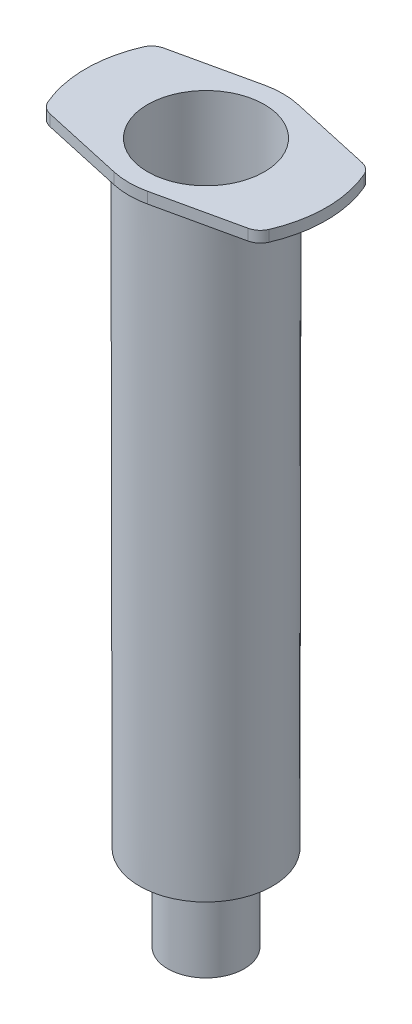
ISO-10303-21;
HEADER;
FILE_DESCRIPTION(('STEP AP214'),'2;1');
FILE_NAME('part.step','',(''),(''),'','','');
FILE_SCHEMA(('AUTOMOTIVE_DESIGN { 1 0 10303 214 1 1 1 1 }'));
ENDSEC;
DATA;
#1=APPLICATION_CONTEXT('core data for automotive mechanical design processes');
#2=APPLICATION_PROTOCOL_DEFINITION('international standard','automotive_design',2000,#1);
#3=PRODUCT_CONTEXT('',#1,'mechanical');
#4=PRODUCT('Part','Part','',(#3));
#5=PRODUCT_RELATED_PRODUCT_CATEGORY('part','',(#4));
#6=PRODUCT_DEFINITION_FORMATION('','',#4);
#7=PRODUCT_DEFINITION_CONTEXT('part definition',#1,'design');
#8=PRODUCT_DEFINITION('design','',#6,#7);
#9=PRODUCT_DEFINITION_SHAPE('','',#8);
#10=(LENGTH_UNIT() NAMED_UNIT(*) SI_UNIT(.MILLI.,.METRE.));
#11=(NAMED_UNIT(*) PLANE_ANGLE_UNIT() SI_UNIT($,.RADIAN.));
#12=(NAMED_UNIT(*) SI_UNIT($,.STERADIAN.) SOLID_ANGLE_UNIT());
#13=UNCERTAINTY_MEASURE_WITH_UNIT(LENGTH_MEASURE(1.E-05),#10,'distance_accuracy_value','');
#14=(GEOMETRIC_REPRESENTATION_CONTEXT(3) GLOBAL_UNCERTAINTY_ASSIGNED_CONTEXT((#13)) GLOBAL_UNIT_ASSIGNED_CONTEXT((#10,
#11,#12)) REPRESENTATION_CONTEXT('',''));
#15=CARTESIAN_POINT('',(0.,0.,0.));
#16=DIRECTION('',(0.,0.,1.));
#17=DIRECTION('',(1.,0.,0.));
#18=AXIS2_PLACEMENT_3D('',#15,#16,#17);
#19=CARTESIAN_POINT('',(0.,0.,0.));
#20=DIRECTION('',(0.,-1.,0.));
#21=DIRECTION('',(0.,0.,-1.));
#22=AXIS2_PLACEMENT_3D('',#19,#20,#21);
#23=CYLINDRICAL_SURFACE('',#22,7.2);
#24=CARTESIAN_POINT('',(0.,11.2004935058267,0.));
#25=DIRECTION('',(0.,-1.,0.));
#26=DIRECTION('',(0.,0.,-1.));
#27=AXIS2_PLACEMENT_3D('',#24,#25,#26);
#28=CIRCLE('',#27,7.2);
#29=CARTESIAN_POINT('',(0.,11.2004935058267,-7.2));
#30=VERTEX_POINT('',#29);
#31=EDGE_CURVE('E218',#30,#30,#28,.T.);
#32=ORIENTED_EDGE('',*,*,#31,.T.);
#33=EDGE_LOOP('',(#32));
#34=FACE_BOUND('',#33,.T.);
#35=CARTESIAN_POINT('',(0.,86.37,0.));
#36=DIRECTION('',(0.,1.,0.));
#37=DIRECTION('',(0.,0.,1.));
#38=AXIS2_PLACEMENT_3D('',#35,#36,#37);
#39=CIRCLE('',#38,7.2);
#40=CARTESIAN_POINT('',(0.,86.37,7.2));
#41=VERTEX_POINT('',#40);
#42=EDGE_CURVE('E155',#41,#41,#39,.T.);
#43=ORIENTED_EDGE('',*,*,#42,.T.);
#44=EDGE_LOOP('',(#43));
#45=FACE_BOUND('',#44,.T.);
#46=ADVANCED_FACE('F36',(#34,#45),#23,.F.);
#47=CARTESIAN_POINT('',(0.,11.2004935058267,0.));
#48=DIRECTION('',(0.,1.,0.));
#49=DIRECTION('',(0.,0.,1.));
#50=AXIS2_PLACEMENT_3D('',#47,#48,#49);
#51=CONICAL_SURFACE('',#50,7.2,1.11606303899452);
#52=CARTESIAN_POINT('',(0.,8.16927474800023,0.));
#53=DIRECTION('',(0.,-1.,0.));
#54=DIRECTION('',(0.,0.,-1.));
#55=AXIS2_PLACEMENT_3D('',#52,#53,#54);
#56=CIRCLE('',#55,1.);
#57=CARTESIAN_POINT('',(0.,8.16927474800023,-1.));
#58=VERTEX_POINT('',#57);
#59=EDGE_CURVE('E215',#58,#58,#56,.T.);
#60=ORIENTED_EDGE('',*,*,#59,.T.);
#61=EDGE_LOOP('',(#60));
#62=FACE_BOUND('',#61,.T.);
#63=ORIENTED_EDGE('',*,*,#31,.F.);
#64=EDGE_LOOP('',(#63));
#65=FACE_BOUND('',#64,.T.);
#66=ADVANCED_FACE('F298',(#62,#65),#51,.F.);
#67=CARTESIAN_POINT('',(0.,0.,0.));
#68=DIRECTION('',(0.,-1.,0.));
#69=DIRECTION('',(0.,0.,-1.));
#70=AXIS2_PLACEMENT_3D('',#67,#68,#69);
#71=CYLINDRICAL_SURFACE('',#70,1.);
#72=CARTESIAN_POINT('',(0.,0.,0.));
#73=DIRECTION('',(0.,-1.,0.));
#74=DIRECTION('',(0.,0.,-1.));
#75=AXIS2_PLACEMENT_3D('',#72,#73,#74);
#76=CIRCLE('',#75,1.);
#77=CARTESIAN_POINT('',(0.,0.,-1.));
#78=VERTEX_POINT('',#77);
#79=EDGE_CURVE('E212',#78,#78,#76,.T.);
#80=ORIENTED_EDGE('',*,*,#79,.T.);
#81=EDGE_LOOP('',(#80));
#82=FACE_BOUND('',#81,.T.);
#83=ORIENTED_EDGE('',*,*,#59,.F.);
#84=EDGE_LOOP('',(#83));
#85=FACE_BOUND('',#84,.T.);
#86=ADVANCED_FACE('F304',(#82,#85),#71,.F.);
#87=CARTESIAN_POINT('',(2.,0.,0.));
#88=DIRECTION('',(0.,-1.,0.));
#89=DIRECTION('',(0.,0.,-1.));
#90=AXIS2_PLACEMENT_3D('',#87,#88,#89);
#91=PLANE('',#90);
#92=CARTESIAN_POINT('',(0.,0.,0.));
#93=DIRECTION('',(0.,-1.,0.));
#94=DIRECTION('',(0.,0.,-1.));
#95=AXIS2_PLACEMENT_3D('',#92,#93,#94);
#96=CIRCLE('',#95,2.);
#97=CARTESIAN_POINT('',(0.,0.,-2.));
#98=VERTEX_POINT('',#97);
#99=EDGE_CURVE('E209',#98,#98,#96,.T.);
#100=ORIENTED_EDGE('',*,*,#99,.T.);
#101=EDGE_LOOP('',(#100));
#102=FACE_BOUND('',#101,.T.);
#103=ORIENTED_EDGE('',*,*,#79,.F.);
#104=EDGE_LOOP('',(#103));
#105=FACE_BOUND('',#104,.T.);
#106=ADVANCED_FACE('F475',(#102,#105),#91,.T.);
#107=CARTESIAN_POINT('',(0.,0.,0.));
#108=DIRECTION('',(0.,-1.,0.));
#109=DIRECTION('',(0.,0.,-1.));
#110=AXIS2_PLACEMENT_3D('',#107,#108,#109);
#111=CYLINDRICAL_SURFACE('',#110,2.);
#112=CARTESIAN_POINT('',(0.,4.39112903225807,0.));
#113=DIRECTION('',(0.,-1.,0.));
#114=DIRECTION('',(0.,0.,-1.));
#115=AXIS2_PLACEMENT_3D('',#112,#113,#114);
#116=CIRCLE('',#115,2.);
#117=CARTESIAN_POINT('',(0.,4.39112903225807,-2.));
#118=VERTEX_POINT('',#117);
#119=EDGE_CURVE('E206',#118,#118,#116,.T.);
#120=ORIENTED_EDGE('',*,*,#119,.T.);
#121=EDGE_LOOP('',(#120));
#122=FACE_BOUND('',#121,.T.);
#123=ORIENTED_EDGE('',*,*,#99,.F.);
#124=EDGE_LOOP('',(#123));
#125=FACE_BOUND('',#124,.T.);
#126=ADVANCED_FACE('F466',(#122,#125),#111,.T.);
#127=CARTESIAN_POINT('',(3.96,4.39112903225807,0.));
#128=DIRECTION('',(0.,-1.,0.));
#129=DIRECTION('',(0.,0.,-1.));
#130=AXIS2_PLACEMENT_3D('',#127,#128,#129);
#131=PLANE('',#130);
#132=CARTESIAN_POINT('',(0.,4.39112903225807,0.));
#133=DIRECTION('',(0.,-1.,0.));
#134=DIRECTION('',(0.,0.,-1.));
#135=AXIS2_PLACEMENT_3D('',#132,#133,#134);
#136=CIRCLE('',#135,3.96);
#137=CARTESIAN_POINT('',(0.,4.39112903225807,-3.96));
#138=VERTEX_POINT('',#137);
#139=EDGE_CURVE('E203',#138,#138,#136,.T.);
#140=ORIENTED_EDGE('',*,*,#139,.T.);
#141=EDGE_LOOP('',(#140));
#142=FACE_BOUND('',#141,.T.);
#143=ORIENTED_EDGE('',*,*,#119,.F.);
#144=EDGE_LOOP('',(#143));
#145=FACE_BOUND('',#144,.T.);
#146=ADVANCED_FACE('F457',(#142,#145),#131,.T.);
#147=CARTESIAN_POINT('',(0.,0.,0.));
#148=DIRECTION('',(0.,-1.,0.));
#149=DIRECTION('',(0.,0.,-1.));
#150=AXIS2_PLACEMENT_3D('',#147,#148,#149);
#151=CYLINDRICAL_SURFACE('',#150,3.96);
#152=CARTESIAN_POINT('',(0.,0.,0.));
#153=DIRECTION('',(0.,-1.,0.));
#154=DIRECTION('',(0.,0.,-1.));
#155=AXIS2_PLACEMENT_3D('',#152,#153,#154);
#156=CIRCLE('',#155,3.96);
#157=CARTESIAN_POINT('',(0.,0.,-3.96));
#158=VERTEX_POINT('',#157);
#159=EDGE_CURVE('E200',#158,#158,#156,.T.);
#160=ORIENTED_EDGE('',*,*,#159,.T.);
#161=EDGE_LOOP('',(#160));
#162=FACE_BOUND('',#161,.T.);
#163=ORIENTED_EDGE('',*,*,#139,.F.);
#164=EDGE_LOOP('',(#163));
#165=FACE_BOUND('',#164,.T.);
#166=ADVANCED_FACE('F448',(#162,#165),#151,.F.);
#167=CARTESIAN_POINT('',(4.71,0.,0.));
#168=DIRECTION('',(0.,-1.,0.));
#169=DIRECTION('',(0.,0.,-1.));
#170=AXIS2_PLACEMENT_3D('',#167,#168,#169);
#171=PLANE('',#170);
#172=CARTESIAN_POINT('',(0.,0.,0.));
#173=DIRECTION('',(0.,-1.,0.));
#174=DIRECTION('',(0.,0.,-1.));
#175=AXIS2_PLACEMENT_3D('',#172,#173,#174);
#176=CIRCLE('',#175,4.71);
#177=CARTESIAN_POINT('',(0.,0.,-4.71));
#178=VERTEX_POINT('',#177);
#179=EDGE_CURVE('E197',#178,#178,#176,.T.);
#180=ORIENTED_EDGE('',*,*,#179,.T.);
#181=EDGE_LOOP('',(#180));
#182=FACE_BOUND('',#181,.T.);
#183=ORIENTED_EDGE('',*,*,#159,.F.);
#184=EDGE_LOOP('',(#183));
#185=FACE_BOUND('',#184,.T.);
#186=ADVANCED_FACE('F439',(#182,#185),#171,.T.);
#187=CARTESIAN_POINT('',(0.,0.,0.));
#188=DIRECTION('',(0.,-1.,0.));
#189=DIRECTION('',(0.,0.,-1.));
#190=AXIS2_PLACEMENT_3D('',#187,#188,#189);
#191=CYLINDRICAL_SURFACE('',#190,4.71);
#192=CARTESIAN_POINT('',(0.,8.87,0.));
#193=DIRECTION('',(0.,-1.,0.));
#194=DIRECTION('',(0.,0.,-1.));
#195=AXIS2_PLACEMENT_3D('',#192,#193,#194);
#196=CIRCLE('',#195,4.71);
#197=CARTESIAN_POINT('',(0.,8.87,-4.71));
#198=VERTEX_POINT('',#197);
#199=EDGE_CURVE('E194',#198,#198,#196,.T.);
#200=ORIENTED_EDGE('',*,*,#199,.T.);
#201=EDGE_LOOP('',(#200));
#202=FACE_BOUND('',#201,.T.);
#203=ORIENTED_EDGE('',*,*,#179,.F.);
#204=EDGE_LOOP('',(#203));
#205=FACE_BOUND('',#204,.T.);
#206=ADVANCED_FACE('F430',(#202,#205),#191,.T.);
#207=CARTESIAN_POINT('',(0.,8.87,0.));
#208=DIRECTION('',(0.,1.,0.));
#209=DIRECTION('',(0.,0.,1.));
#210=AXIS2_PLACEMENT_3D('',#207,#208,#209);
#211=CONICAL_SURFACE('',#210,4.71,1.11606303899452);
#212=CARTESIAN_POINT('',(0.,10.5762828169055,0.));
#213=DIRECTION('',(0.,-1.,0.));
#214=DIRECTION('',(0.,0.,-1.));
#215=AXIS2_PLACEMENT_3D('',#212,#213,#214);
#216=CIRCLE('',#215,8.2);
#217=CARTESIAN_POINT('',(0.,10.5762828169055,-8.2));
#218=VERTEX_POINT('',#217);
#219=EDGE_CURVE('E187',#218,#218,#216,.T.);
#220=ORIENTED_EDGE('',*,*,#219,.T.);
#221=EDGE_LOOP('',(#220));
#222=FACE_BOUND('',#221,.T.);
#223=ORIENTED_EDGE('',*,*,#199,.F.);
#224=EDGE_LOOP('',(#223));
#225=FACE_BOUND('',#224,.T.);
#226=ADVANCED_FACE('F421',(#222,#225),#211,.T.);
#227=CARTESIAN_POINT('',(0.,10.5762828169055,0.));
#228=DIRECTION('',(0.,1.,0.));
#229=DIRECTION('',(0.,0.,1.));
#230=AXIS2_PLACEMENT_3D('',#227,#228,#229);
#231=CONICAL_SURFACE('',#230,8.2,0.00131936980652194);
#232=CARTESIAN_POINT('',(0.,85.,0.));
#233=DIRECTION('',(0.,-1.,0.));
#234=DIRECTION('',(0.,0.,-1.));
#235=AXIS2_PLACEMENT_3D('',#232,#233,#234);
#236=CIRCLE('',#235,8.29819246231625);
#237=CARTESIAN_POINT('',(0.,85.,-8.29819246231625));
#238=VERTEX_POINT('',#237);
#239=EDGE_CURVE('E221',#238,#238,#236,.F.);
#240=ORIENTED_EDGE('',*,*,#239,.F.);
#241=EDGE_LOOP('',(#240));
#242=FACE_BOUND('',#241,.T.);
#243=ORIENTED_EDGE('',*,*,#219,.F.);
#244=EDGE_LOOP('',(#243));
#245=FACE_BOUND('',#244,.T.);
#246=ADVANCED_FACE('F413',(#242,#245),#231,.T.);
#247=CARTESIAN_POINT('',(0.,85.,0.));
#248=DIRECTION('',(0.,-1.,0.));
#249=DIRECTION('',(0.,0.,-1.));
#250=AXIS2_PLACEMENT_3D('',#247,#248,#249);
#251=PLANE('',#250);
#252=ORIENTED_EDGE('',*,*,#239,.T.);
#253=EDGE_LOOP('',(#252));
#254=FACE_BOUND('',#253,.T.);
#255=CARTESIAN_POINT('',(-2.96637714392034E-13,85.,0.));
#256=DIRECTION('',(0.,1.,0.));
#257=DIRECTION('',(0.,0.,-1.));
#258=AXIS2_PLACEMENT_3D('',#255,#256,#257);
#259=CIRCLE('',#258,14.8350000000003);
#260=CARTESIAN_POINT('',(13.6296178650865,85.,5.85753718312704));
#261=VERTEX_POINT('',#260);
#262=CARTESIAN_POINT('',(13.6296178650865,85.,-5.85753718312704));
#263=VERTEX_POINT('',#262);
#264=EDGE_CURVE('E166',#261,#263,#259,.T.);
#265=ORIENTED_EDGE('',*,*,#264,.F.);
#266=CARTESIAN_POINT('',(11.792123039999,85.,5.06784561816217));
#267=DIRECTION('',(0.,-1.,0.));
#268=DIRECTION('',(0.,0.,-1.));
#269=AXIS2_PLACEMENT_3D('',#266,#267,#268);
#270=CIRCLE('',#269,2.);
#271=CARTESIAN_POINT('',(12.2250022678752,85.,7.02043763240204));
#272=VERTEX_POINT('',#271);
#273=EDGE_CURVE('E244',#261,#272,#270,.T.);
#274=ORIENTED_EDGE('',*,*,#273,.T.);
#275=DIRECTION('',(0.976296007119933,0.,-0.216439613938107));
#276=VECTOR('',#275,1.);
#277=CARTESIAN_POINT('',(2.05617633241201,85.,9.27481206763936));
#278=LINE('',#277,#276);
#279=CARTESIAN_POINT('',(2.05617633241201,85.,9.27481206763936));
#280=VERTEX_POINT('',#279);
#281=EDGE_CURVE('E163',#280,#272,#278,.T.);
#282=ORIENTED_EDGE('',*,*,#281,.F.);
#283=CARTESIAN_POINT('',(0.,85.,0.));
#284=DIRECTION('',(0.,1.,0.));
#285=DIRECTION('',(0.,0.,-1.));
#286=AXIS2_PLACEMENT_3D('',#283,#284,#285);
#287=CIRCLE('',#286,9.5);
#288=CARTESIAN_POINT('',(-2.05617633241201,85.,9.27481206763936));
#289=VERTEX_POINT('',#288);
#290=EDGE_CURVE('E160',#289,#280,#287,.T.);
#291=ORIENTED_EDGE('',*,*,#290,.F.);
#292=DIRECTION('',(0.976296007119933,0.,0.216439613938107));
#293=VECTOR('',#292,1.);
#294=CARTESIAN_POINT('',(-2.05617633241201,85.,9.27481206763936));
#295=LINE('',#294,#293);
#296=CARTESIAN_POINT('',(-12.2250022678752,85.,7.02043763240203));
#297=VERTEX_POINT('',#296);
#298=EDGE_CURVE('E158',#297,#289,#295,.T.);
#299=ORIENTED_EDGE('',*,*,#298,.F.);
#300=CARTESIAN_POINT('',(-11.792123039999,85.,5.06784561816217));
#301=DIRECTION('',(0.,-1.,0.));
#302=DIRECTION('',(0.,0.,-1.));
#303=AXIS2_PLACEMENT_3D('',#300,#301,#302);
#304=CIRCLE('',#303,2.);
#305=CARTESIAN_POINT('',(-13.6296178650865,85.,5.85753718312707));
#306=VERTEX_POINT('',#305);
#307=EDGE_CURVE('E57',#297,#306,#304,.T.);
#308=ORIENTED_EDGE('',*,*,#307,.T.);
#309=CARTESIAN_POINT('',(-2.96637714392034E-13,85.,0.));
#310=DIRECTION('',(0.,1.,0.));
#311=DIRECTION('',(0.,0.,1.));
#312=AXIS2_PLACEMENT_3D('',#309,#310,#311);
#313=CIRCLE('',#312,14.8349999999997);
#314=CARTESIAN_POINT('',(-13.6296178650865,85.,-5.85753718312707));
#315=VERTEX_POINT('',#314);
#316=EDGE_CURVE('E144',#315,#306,#313,.T.);
#317=ORIENTED_EDGE('',*,*,#316,.F.);
#318=CARTESIAN_POINT('',(-11.792123039999,85.,-5.06784561816217));
#319=DIRECTION('',(0.,-1.,0.));
#320=DIRECTION('',(0.,0.,-1.));
#321=AXIS2_PLACEMENT_3D('',#318,#319,#320);
#322=CIRCLE('',#321,2.);
#323=CARTESIAN_POINT('',(-12.2250022678752,85.,-7.02043763240203));
#324=VERTEX_POINT('',#323);
#325=EDGE_CURVE('E51',#315,#324,#322,.T.);
#326=ORIENTED_EDGE('',*,*,#325,.T.);
#327=DIRECTION('',(-0.976296007119933,0.,0.216439613938107));
#328=VECTOR('',#327,1.);
#329=CARTESIAN_POINT('',(-2.05617633241201,85.,-9.27481206763936));
#330=LINE('',#329,#328);
#331=CARTESIAN_POINT('',(-2.05617633241201,85.,-9.27481206763936));
#332=VERTEX_POINT('',#331);
#333=EDGE_CURVE('E128',#332,#324,#330,.T.);
#334=ORIENTED_EDGE('',*,*,#333,.F.);
#335=CARTESIAN_POINT('',(0.,85.,0.));
#336=DIRECTION('',(0.,1.,0.));
#337=DIRECTION('',(0.,0.,-1.));
#338=AXIS2_PLACEMENT_3D('',#335,#336,#337);
#339=CIRCLE('',#338,9.5);
#340=CARTESIAN_POINT('',(2.05617633241201,85.,-9.27481206763936));
#341=VERTEX_POINT('',#340);
#342=EDGE_CURVE('E143',#341,#332,#339,.T.);
#343=ORIENTED_EDGE('',*,*,#342,.F.);
#344=DIRECTION('',(-0.976296007119933,0.,-0.216439613938107));
#345=VECTOR('',#344,1.);
#346=CARTESIAN_POINT('',(2.05617633241201,85.,-9.27481206763936));
#347=LINE('',#346,#345);
#348=CARTESIAN_POINT('',(12.2250022678752,85.,-7.02043763240204));
#349=VERTEX_POINT('',#348);
#350=EDGE_CURVE('E137',#349,#341,#347,.T.);
#351=ORIENTED_EDGE('',*,*,#350,.F.);
#352=CARTESIAN_POINT('',(11.792123039999,85.,-5.06784561816217));
#353=DIRECTION('',(0.,-1.,0.));
#354=DIRECTION('',(0.,0.,-1.));
#355=AXIS2_PLACEMENT_3D('',#352,#353,#354);
#356=CIRCLE('',#355,2.);
#357=EDGE_CURVE('E240',#349,#263,#356,.T.);
#358=ORIENTED_EDGE('',*,*,#357,.T.);
#359=EDGE_LOOP('',(#265,#274,#282,#291,#299,#308,#317,#326,#334,#343,#351,#358));
#360=FACE_BOUND('',#359,.T.);
#361=ADVANCED_FACE('F141',(#254,#360),#251,.T.);
#362=CARTESIAN_POINT('',(-2.05617633241201,85.,-9.27481206763936));
#363=DIRECTION('',(-0.216439613938107,0.,-0.976296007119933));
#364=DIRECTION('',(-0.976296007119933,0.,0.216439613938107));
#365=AXIS2_PLACEMENT_3D('',#362,#363,#364);
#366=PLANE('',#365);
#367=ORIENTED_EDGE('',*,*,#333,.T.);
#368=DIRECTION('',(0.,1.,0.));
#369=VECTOR('',#368,1.);
#370=CARTESIAN_POINT('',(-12.2250022678752,85.,-7.02043763240203));
#371=LINE('',#370,#369);
#372=CARTESIAN_POINT('',(-12.2250022678752,86.37,-7.02043763240203));
#373=VERTEX_POINT('',#372);
#374=EDGE_CURVE('E44',#324,#373,#371,.T.);
#375=ORIENTED_EDGE('',*,*,#374,.T.);
#376=DIRECTION('',(-0.976296007119933,0.,0.216439613938107));
#377=VECTOR('',#376,1.);
#378=CARTESIAN_POINT('',(-2.05617633241201,86.37,-9.27481206763936));
#379=LINE('',#378,#377);
#380=CARTESIAN_POINT('',(-2.05617633241201,86.37,-9.27481206763936));
#381=VERTEX_POINT('',#380);
#382=EDGE_CURVE('E131',#381,#373,#379,.T.);
#383=ORIENTED_EDGE('',*,*,#382,.F.);
#384=DIRECTION('',(0.,1.,0.));
#385=VECTOR('',#384,1.);
#386=CARTESIAN_POINT('',(-2.05617633241201,85.,-9.27481206763936));
#387=LINE('',#386,#385);
#388=EDGE_CURVE('E125',#332,#381,#387,.T.);
#389=ORIENTED_EDGE('',*,*,#388,.F.);
#390=EDGE_LOOP('',(#367,#375,#383,#389));
#391=FACE_BOUND('',#390,.T.);
#392=ADVANCED_FACE('F126',(#391),#366,.T.);
#393=CARTESIAN_POINT('',(-2.96637714392034E-13,85.,0.));
#394=DIRECTION('',(0.,1.,0.));
#395=DIRECTION('',(0.,0.,1.));
#396=AXIS2_PLACEMENT_3D('',#393,#394,#395);
#397=CYLINDRICAL_SURFACE('',#396,14.8349999999997);
#398=ORIENTED_EDGE('',*,*,#316,.T.);
#399=DIRECTION('',(0.,1.,0.));
#400=VECTOR('',#399,1.);
#401=CARTESIAN_POINT('',(-13.6296178650865,85.,5.85753718312707));
#402=LINE('',#401,#400);
#403=CARTESIAN_POINT('',(-13.6296178650865,86.37,5.85753718312707));
#404=VERTEX_POINT('',#403);
#405=EDGE_CURVE('E248',#306,#404,#402,.T.);
#406=ORIENTED_EDGE('',*,*,#405,.T.);
#407=CARTESIAN_POINT('',(-2.96637714392034E-13,86.37,0.));
#408=DIRECTION('',(0.,1.,0.));
#409=DIRECTION('',(0.,0.,1.));
#410=AXIS2_PLACEMENT_3D('',#407,#408,#409);
#411=CIRCLE('',#410,14.8349999999997);
#412=CARTESIAN_POINT('',(-13.6296178650865,86.37,-5.85753718312707));
#413=VERTEX_POINT('',#412);
#414=EDGE_CURVE('E173',#413,#404,#411,.T.);
#415=ORIENTED_EDGE('',*,*,#414,.F.);
#416=DIRECTION('',(0.,1.,0.));
#417=VECTOR('',#416,1.);
#418=CARTESIAN_POINT('',(-13.6296178650865,85.,-5.85753718312707));
#419=LINE('',#418,#417);
#420=EDGE_CURVE('E246',#413,#315,#419,.F.);
#421=ORIENTED_EDGE('',*,*,#420,.T.);
#422=EDGE_LOOP('',(#398,#406,#415,#421));
#423=FACE_BOUND('',#422,.T.);
#424=ADVANCED_FACE('F288',(#423),#397,.T.);
#425=CARTESIAN_POINT('',(-2.05617633241201,85.,9.27481206763936));
#426=DIRECTION('',(-0.216439613938107,0.,0.976296007119933));
#427=DIRECTION('',(0.976296007119933,0.,0.216439613938107));
#428=AXIS2_PLACEMENT_3D('',#425,#426,#427);
#429=PLANE('',#428);
#430=DIRECTION('',(0.976296007119933,0.,0.216439613938107));
#431=VECTOR('',#430,1.);
#432=CARTESIAN_POINT('',(-2.05617633241201,86.37,9.27481206763936));
#433=LINE('',#432,#431);
#434=CARTESIAN_POINT('',(-12.2250022678752,86.37,7.02043763240203));
#435=VERTEX_POINT('',#434);
#436=CARTESIAN_POINT('',(-2.05617633241201,86.37,9.27481206763936));
#437=VERTEX_POINT('',#436);
#438=EDGE_CURVE('E176',#435,#437,#433,.T.);
#439=ORIENTED_EDGE('',*,*,#438,.F.);
#440=DIRECTION('',(0.,1.,0.));
#441=VECTOR('',#440,1.);
#442=CARTESIAN_POINT('',(-12.2250022678752,85.,7.02043763240203));
#443=LINE('',#442,#441);
#444=EDGE_CURVE('E251',#435,#297,#443,.F.);
#445=ORIENTED_EDGE('',*,*,#444,.T.);
#446=ORIENTED_EDGE('',*,*,#298,.T.);
#447=DIRECTION('',(0.,1.,0.));
#448=VECTOR('',#447,1.);
#449=CARTESIAN_POINT('',(-2.05617633241201,85.,9.27481206763936));
#450=LINE('',#449,#448);
#451=EDGE_CURVE('E136',#289,#437,#450,.T.);
#452=ORIENTED_EDGE('',*,*,#451,.T.);
#453=EDGE_LOOP('',(#439,#445,#446,#452));
#454=FACE_BOUND('',#453,.T.);
#455=ADVANCED_FACE('F282',(#454),#429,.T.);
#456=CARTESIAN_POINT('',(0.,85.,0.));
#457=DIRECTION('',(0.,1.,0.));
#458=DIRECTION('',(0.,0.,1.));
#459=AXIS2_PLACEMENT_3D('',#456,#457,#458);
#460=CYLINDRICAL_SURFACE('',#459,9.5);
#461=CARTESIAN_POINT('',(0.,86.37,0.));
#462=DIRECTION('',(0.,1.,0.));
#463=DIRECTION('',(0.,0.,-1.));
#464=AXIS2_PLACEMENT_3D('',#461,#462,#463);
#465=CIRCLE('',#464,9.5);
#466=CARTESIAN_POINT('',(2.05617633241201,86.37,9.27481206763936));
#467=VERTEX_POINT('',#466);
#468=EDGE_CURVE('E178',#437,#467,#465,.T.);
#469=ORIENTED_EDGE('',*,*,#468,.F.);
#470=ORIENTED_EDGE('',*,*,#451,.F.);
#471=ORIENTED_EDGE('',*,*,#290,.T.);
#472=DIRECTION('',(0.,1.,0.));
#473=VECTOR('',#472,1.);
#474=CARTESIAN_POINT('',(2.05617633241201,85.,9.27481206763936));
#475=LINE('',#474,#473);
#476=EDGE_CURVE('E188',#280,#467,#475,.T.);
#477=ORIENTED_EDGE('',*,*,#476,.T.);
#478=EDGE_LOOP('',(#469,#470,#471,#477));
#479=FACE_BOUND('',#478,.T.);
#480=ADVANCED_FACE('F279',(#479),#460,.T.);
#481=CARTESIAN_POINT('',(2.05617633241201,85.,9.27481206763936));
#482=DIRECTION('',(0.216439613938107,0.,0.976296007119933));
#483=DIRECTION('',(0.976296007119933,0.,-0.216439613938107));
#484=AXIS2_PLACEMENT_3D('',#481,#482,#483);
#485=PLANE('',#484);
#486=ORIENTED_EDGE('',*,*,#281,.T.);
#487=DIRECTION('',(0.,1.,0.));
#488=VECTOR('',#487,1.);
#489=CARTESIAN_POINT('',(12.2250022678752,85.,7.02043763240204));
#490=LINE('',#489,#488);
#491=CARTESIAN_POINT('',(12.2250022678752,86.37,7.02043763240204));
#492=VERTEX_POINT('',#491);
#493=EDGE_CURVE('E224',#272,#492,#490,.T.);
#494=ORIENTED_EDGE('',*,*,#493,.T.);
#495=DIRECTION('',(0.976296007119933,0.,-0.216439613938107));
#496=VECTOR('',#495,1.);
#497=CARTESIAN_POINT('',(2.05617633241201,86.37,9.27481206763936));
#498=LINE('',#497,#496);
#499=EDGE_CURVE('E181',#467,#492,#498,.T.);
#500=ORIENTED_EDGE('',*,*,#499,.F.);
#501=ORIENTED_EDGE('',*,*,#476,.F.);
#502=EDGE_LOOP('',(#486,#494,#500,#501));
#503=FACE_BOUND('',#502,.T.);
#504=ADVANCED_FACE('F273',(#503),#485,.T.);
#505=CARTESIAN_POINT('',(-2.96637714392034E-13,85.,0.));
#506=DIRECTION('',(0.,1.,0.));
#507=DIRECTION('',(0.,0.,1.));
#508=AXIS2_PLACEMENT_3D('',#505,#506,#507);
#509=CYLINDRICAL_SURFACE('',#508,14.8350000000003);
#510=CARTESIAN_POINT('',(-2.96637714392034E-13,86.37,0.));
#511=DIRECTION('',(0.,1.,0.));
#512=DIRECTION('',(0.,0.,-1.));
#513=AXIS2_PLACEMENT_3D('',#510,#511,#512);
#514=CIRCLE('',#513,14.8350000000003);
#515=CARTESIAN_POINT('',(13.6296178650865,86.37,5.85753718312704));
#516=VERTEX_POINT('',#515);
#517=CARTESIAN_POINT('',(13.6296178650865,86.37,-5.85753718312704));
#518=VERTEX_POINT('',#517);
#519=EDGE_CURVE('E152',#516,#518,#514,.T.);
#520=ORIENTED_EDGE('',*,*,#519,.F.);
#521=DIRECTION('',(0.,1.,0.));
#522=VECTOR('',#521,1.);
#523=CARTESIAN_POINT('',(13.6296178650865,85.,5.85753718312704));
#524=LINE('',#523,#522);
#525=EDGE_CURVE('E238',#516,#261,#524,.F.);
#526=ORIENTED_EDGE('',*,*,#525,.T.);
#527=ORIENTED_EDGE('',*,*,#264,.T.);
#528=DIRECTION('',(0.,1.,0.));
#529=VECTOR('',#528,1.);
#530=CARTESIAN_POINT('',(13.6296178650865,85.,-5.85753718312704));
#531=LINE('',#530,#529);
#532=EDGE_CURVE('E235',#263,#518,#531,.T.);
#533=ORIENTED_EDGE('',*,*,#532,.T.);
#534=EDGE_LOOP('',(#520,#526,#527,#533));
#535=FACE_BOUND('',#534,.T.);
#536=ADVANCED_FACE('F265',(#535),#509,.T.);
#537=CARTESIAN_POINT('',(2.05617633241201,85.,-9.27481206763936));
#538=DIRECTION('',(0.216439613938107,0.,-0.976296007119933));
#539=DIRECTION('',(-0.976296007119933,0.,-0.216439613938107));
#540=AXIS2_PLACEMENT_3D('',#537,#538,#539);
#541=PLANE('',#540);
#542=DIRECTION('',(-0.976296007119933,0.,-0.216439613938107));
#543=VECTOR('',#542,1.);
#544=CARTESIAN_POINT('',(2.05617633241201,86.37,-9.27481206763936));
#545=LINE('',#544,#543);
#546=CARTESIAN_POINT('',(12.2250022678752,86.37,-7.02043763240204));
#547=VERTEX_POINT('',#546);
#548=CARTESIAN_POINT('',(2.05617633241201,86.37,-9.27481206763936));
#549=VERTEX_POINT('',#548);
#550=EDGE_CURVE('E150',#547,#549,#545,.T.);
#551=ORIENTED_EDGE('',*,*,#550,.F.);
#552=DIRECTION('',(0.,1.,0.));
#553=VECTOR('',#552,1.);
#554=CARTESIAN_POINT('',(12.2250022678752,85.,-7.02043763240204));
#555=LINE('',#554,#553);
#556=EDGE_CURVE('E11',#547,#349,#555,.F.);
#557=ORIENTED_EDGE('',*,*,#556,.T.);
#558=ORIENTED_EDGE('',*,*,#350,.T.);
#559=DIRECTION('',(0.,1.,0.));
#560=VECTOR('',#559,1.);
#561=CARTESIAN_POINT('',(2.05617633241201,85.,-9.27481206763936));
#562=LINE('',#561,#560);
#563=EDGE_CURVE('E149',#341,#549,#562,.T.);
#564=ORIENTED_EDGE('',*,*,#563,.T.);
#565=EDGE_LOOP('',(#551,#557,#558,#564));
#566=FACE_BOUND('',#565,.T.);
#567=ADVANCED_FACE('F259',(#566),#541,.T.);
#568=CARTESIAN_POINT('',(0.,85.,0.));
#569=DIRECTION('',(0.,1.,0.));
#570=DIRECTION('',(0.,0.,1.));
#571=AXIS2_PLACEMENT_3D('',#568,#569,#570);
#572=CYLINDRICAL_SURFACE('',#571,9.5);
#573=CARTESIAN_POINT('',(0.,86.37,0.));
#574=DIRECTION('',(0.,1.,0.));
#575=DIRECTION('',(0.,0.,-1.));
#576=AXIS2_PLACEMENT_3D('',#573,#574,#575);
#577=CIRCLE('',#576,9.5);
#578=EDGE_CURVE('E170',#549,#381,#577,.T.);
#579=ORIENTED_EDGE('',*,*,#578,.F.);
#580=ORIENTED_EDGE('',*,*,#563,.F.);
#581=ORIENTED_EDGE('',*,*,#342,.T.);
#582=ORIENTED_EDGE('',*,*,#388,.T.);
#583=EDGE_LOOP('',(#579,#580,#581,#582));
#584=FACE_BOUND('',#583,.T.);
#585=ADVANCED_FACE('F147',(#584),#572,.T.);
#586=CARTESIAN_POINT('',(8.3,86.37,0.));
#587=DIRECTION('',(0.,1.,0.));
#588=DIRECTION('',(0.,0.,1.));
#589=AXIS2_PLACEMENT_3D('',#586,#587,#588);
#590=PLANE('',#589);
#591=ORIENTED_EDGE('',*,*,#42,.F.);
#592=EDGE_LOOP('',(#591));
#593=FACE_BOUND('',#592,.T.);
#594=ORIENTED_EDGE('',*,*,#499,.T.);
#595=CARTESIAN_POINT('',(11.792123039999,86.37,5.06784561816217));
#596=DIRECTION('',(0.,1.,0.));
#597=DIRECTION('',(0.,0.,1.));
#598=AXIS2_PLACEMENT_3D('',#595,#596,#597);
#599=CIRCLE('',#598,2.);
#600=EDGE_CURVE('E233',#492,#516,#599,.T.);
#601=ORIENTED_EDGE('',*,*,#600,.T.);
#602=ORIENTED_EDGE('',*,*,#519,.T.);
#603=CARTESIAN_POINT('',(11.792123039999,86.37,-5.06784561816217));
#604=DIRECTION('',(0.,1.,0.));
#605=DIRECTION('',(0.,0.,1.));
#606=AXIS2_PLACEMENT_3D('',#603,#604,#605);
#607=CIRCLE('',#606,2.);
#608=EDGE_CURVE('E227',#518,#547,#607,.T.);
#609=ORIENTED_EDGE('',*,*,#608,.T.);
#610=ORIENTED_EDGE('',*,*,#550,.T.);
#611=ORIENTED_EDGE('',*,*,#578,.T.);
#612=ORIENTED_EDGE('',*,*,#382,.T.);
#613=CARTESIAN_POINT('',(-11.792123039999,86.37,-5.06784561816217));
#614=DIRECTION('',(0.,1.,0.));
#615=DIRECTION('',(0.,0.,1.));
#616=AXIS2_PLACEMENT_3D('',#613,#614,#615);
#617=CIRCLE('',#616,2.);
#618=EDGE_CURVE('E229',#373,#413,#617,.T.);
#619=ORIENTED_EDGE('',*,*,#618,.T.);
#620=ORIENTED_EDGE('',*,*,#414,.T.);
#621=CARTESIAN_POINT('',(-11.792123039999,86.37,5.06784561816217));
#622=DIRECTION('',(0.,1.,0.));
#623=DIRECTION('',(0.,0.,1.));
#624=AXIS2_PLACEMENT_3D('',#621,#622,#623);
#625=CIRCLE('',#624,2.);
#626=EDGE_CURVE('E231',#404,#435,#625,.T.);
#627=ORIENTED_EDGE('',*,*,#626,.T.);
#628=ORIENTED_EDGE('',*,*,#438,.T.);
#629=ORIENTED_EDGE('',*,*,#468,.T.);
#630=EDGE_LOOP('',(#594,#601,#602,#609,#610,#611,#612,#619,#620,#627,#628,#629));
#631=FACE_BOUND('',#630,.T.);
#632=ADVANCED_FACE('F254',(#593,#631),#590,.T.);
#633=CARTESIAN_POINT('',(11.792123039999,85.,5.06784561816217));
#634=DIRECTION('',(0.,1.,0.));
#635=DIRECTION('',(0.,0.,1.));
#636=AXIS2_PLACEMENT_3D('',#633,#634,#635);
#637=CYLINDRICAL_SURFACE('',#636,2.);
#638=ORIENTED_EDGE('',*,*,#273,.F.);
#639=ORIENTED_EDGE('',*,*,#525,.F.);
#640=ORIENTED_EDGE('',*,*,#600,.F.);
#641=ORIENTED_EDGE('',*,*,#493,.F.);
#642=EDGE_LOOP('',(#638,#639,#640,#641));
#643=FACE_BOUND('',#642,.T.);
#644=ADVANCED_FACE('F271',(#643),#637,.T.);
#645=CARTESIAN_POINT('',(-11.792123039999,85.,5.06784561816217));
#646=DIRECTION('',(0.,1.,0.));
#647=DIRECTION('',(0.,0.,1.));
#648=AXIS2_PLACEMENT_3D('',#645,#646,#647);
#649=CYLINDRICAL_SURFACE('',#648,2.);
#650=ORIENTED_EDGE('',*,*,#307,.F.);
#651=ORIENTED_EDGE('',*,*,#444,.F.);
#652=ORIENTED_EDGE('',*,*,#626,.F.);
#653=ORIENTED_EDGE('',*,*,#405,.F.);
#654=EDGE_LOOP('',(#650,#651,#652,#653));
#655=FACE_BOUND('',#654,.T.);
#656=ADVANCED_FACE('F286',(#655),#649,.T.);
#657=CARTESIAN_POINT('',(-11.792123039999,85.,-5.06784561816217));
#658=DIRECTION('',(0.,1.,0.));
#659=DIRECTION('',(0.,0.,1.));
#660=AXIS2_PLACEMENT_3D('',#657,#658,#659);
#661=CYLINDRICAL_SURFACE('',#660,2.);
#662=ORIENTED_EDGE('',*,*,#325,.F.);
#663=ORIENTED_EDGE('',*,*,#420,.F.);
#664=ORIENTED_EDGE('',*,*,#618,.F.);
#665=ORIENTED_EDGE('',*,*,#374,.F.);
#666=EDGE_LOOP('',(#662,#663,#664,#665));
#667=FACE_BOUND('',#666,.T.);
#668=ADVANCED_FACE('F290',(#667),#661,.T.);
#669=CARTESIAN_POINT('',(11.792123039999,85.,-5.06784561816217));
#670=DIRECTION('',(0.,1.,0.));
#671=DIRECTION('',(0.,0.,1.));
#672=AXIS2_PLACEMENT_3D('',#669,#670,#671);
#673=CYLINDRICAL_SURFACE('',#672,2.);
#674=ORIENTED_EDGE('',*,*,#357,.F.);
#675=ORIENTED_EDGE('',*,*,#556,.F.);
#676=ORIENTED_EDGE('',*,*,#608,.F.);
#677=ORIENTED_EDGE('',*,*,#532,.F.);
#678=EDGE_LOOP('',(#674,#675,#676,#677));
#679=FACE_BOUND('',#678,.T.);
#680=ADVANCED_FACE('F38',(#679),#673,.T.);
#681=CLOSED_SHELL('',(#46,#66,#86,#106,#126,#146,#166,#186,#206,#226,#246,#361,#392,#424,#455,
#480,#504,#536,#567,#585,#632,#644,#656,#668,#680));
#682=MANIFOLD_SOLID_BREP('B2',#681);
#683=ADVANCED_BREP_SHAPE_REPRESENTATION('',(#18,#682),#14);
#684=SHAPE_DEFINITION_REPRESENTATION(#9,#683);
ENDSEC;
END-ISO-10303-21;
